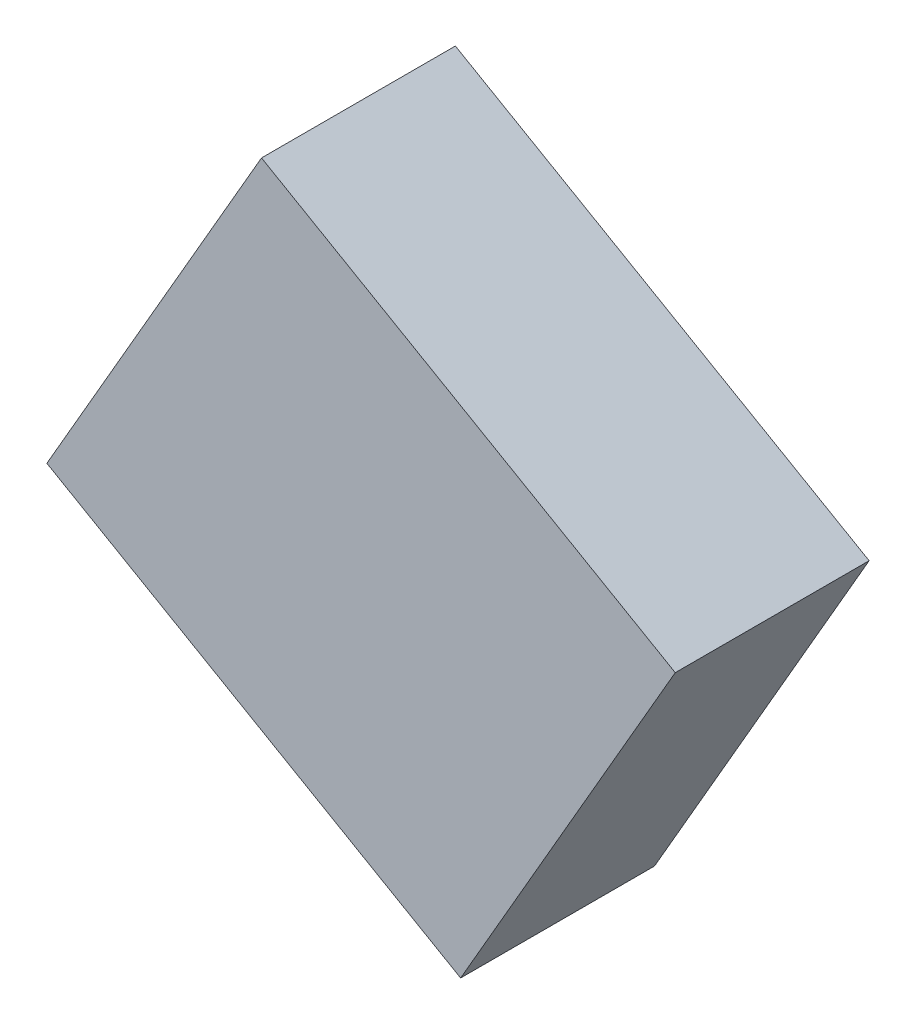
ISO-10303-21;
HEADER;
FILE_DESCRIPTION(('STEP AP214'),'2;1');
FILE_NAME('part.step','',(''),(''),'','','');
FILE_SCHEMA(('AUTOMOTIVE_DESIGN { 1 0 10303 214 1 1 1 1 }'));
ENDSEC;
DATA;
#1=APPLICATION_CONTEXT('core data for automotive mechanical design processes');
#2=APPLICATION_PROTOCOL_DEFINITION('international standard','automotive_design',2000,#1);
#3=PRODUCT_CONTEXT('',#1,'mechanical');
#4=PRODUCT('Part','Part','',(#3));
#5=PRODUCT_RELATED_PRODUCT_CATEGORY('part','',(#4));
#6=PRODUCT_DEFINITION_FORMATION('','',#4);
#7=PRODUCT_DEFINITION_CONTEXT('part definition',#1,'design');
#8=PRODUCT_DEFINITION('design','',#6,#7);
#9=PRODUCT_DEFINITION_SHAPE('','',#8);
#10=(LENGTH_UNIT() NAMED_UNIT(*) SI_UNIT(.MILLI.,.METRE.));
#11=(NAMED_UNIT(*) PLANE_ANGLE_UNIT() SI_UNIT($,.RADIAN.));
#12=(NAMED_UNIT(*) SI_UNIT($,.STERADIAN.) SOLID_ANGLE_UNIT());
#13=UNCERTAINTY_MEASURE_WITH_UNIT(LENGTH_MEASURE(1.E-05),#10,'distance_accuracy_value','');
#14=(GEOMETRIC_REPRESENTATION_CONTEXT(3) GLOBAL_UNCERTAINTY_ASSIGNED_CONTEXT((#13)) GLOBAL_UNIT_ASSIGNED_CONTEXT((#10,
#11,#12)) REPRESENTATION_CONTEXT('',''));
#15=CARTESIAN_POINT('',(0.,0.,0.));
#16=DIRECTION('',(0.,0.,1.));
#17=DIRECTION('',(1.,0.,0.));
#18=AXIS2_PLACEMENT_3D('',#15,#16,#17);
#19=CARTESIAN_POINT('',(-0.71889366,2.20483938,1.39999974));
#20=DIRECTION('',(0.,0.,-1.));
#21=DIRECTION('',(-1.,0.,0.));
#22=AXIS2_PLACEMENT_3D('',#19,#20,#21);
#23=PLANE('',#22);
#24=DIRECTION('',(-0.8660251598711,0.500000422470058,0.));
#25=VECTOR('',#24,1.);
#26=CARTESIAN_POINT('',(-2.2688931,-0.47983648,1.39999974));
#27=LINE('',#26,#25);
#28=CARTESIAN_POINT('',(-2.26889310000001,-0.479836479999993,1.39999974));
#29=VERTEX_POINT('',#28);
#30=CARTESIAN_POINT('',(0.718896199999887,-2.2048393800002,1.39999974));
#31=VERTEX_POINT('',#30);
#32=EDGE_CURVE('E55',#29,#31,#27,.F.);
#33=ORIENTED_EDGE('',*,*,#32,.T.);
#34=DIRECTION('',(-0.499999913646723,-0.866025453640521,0.));
#35=VECTOR('',#34,1.);
#36=CARTESIAN_POINT('',(0.7188962,-2.20483938,1.39999974));
#37=LINE('',#36,#35);
#38=CARTESIAN_POINT('',(2.26889564000015,0.479839019999916,1.39999974));
#39=VERTEX_POINT('',#38);
#40=EDGE_CURVE('E57',#31,#39,#37,.F.);
#41=ORIENTED_EDGE('',*,*,#40,.T.);
#42=DIRECTION('',(0.866025478669049,-0.499999870296028,0.));
#43=VECTOR('',#42,1.);
#44=CARTESIAN_POINT('',(2.26889564,0.47983902,1.39999974));
#45=LINE('',#44,#43);
#46=CARTESIAN_POINT('',(-0.718893660000355,2.20483937999939,1.39999974));
#47=VERTEX_POINT('',#46);
#48=EDGE_CURVE('E20',#39,#47,#45,.F.);
#49=ORIENTED_EDGE('',*,*,#48,.T.);
#50=DIRECTION('',(0.500000268437841,0.866025248801724,0.));
#51=VECTOR('',#50,1.);
#52=CARTESIAN_POINT('',(-0.71889366,2.20483938,1.39999974));
#53=LINE('',#52,#51);
#54=EDGE_CURVE('E80',#47,#29,#53,.F.);
#55=ORIENTED_EDGE('',*,*,#54,.T.);
#56=EDGE_LOOP('',(#33,#41,#49,#55));
#57=FACE_BOUND('',#56,.T.);
#58=ADVANCED_FACE('F17',(#57),#23,.F.);
#59=CARTESIAN_POINT('',(2.26889564,0.47983902,0.));
#60=DIRECTION('',(-0.499999870296028,-0.866025478669049,0.));
#61=DIRECTION('',(0.866025478669049,-0.499999870296028,0.));
#62=AXIS2_PLACEMENT_3D('',#59,#60,#61);
#63=PLANE('',#62);
#64=DIRECTION('',(0.,0.,1.));
#65=VECTOR('',#64,1.);
#66=CARTESIAN_POINT('',(-0.71889366,2.20483938,0.));
#67=LINE('',#66,#65);
#68=CARTESIAN_POINT('',(-0.718893660000355,2.20483937999939,0.));
#69=VERTEX_POINT('',#68);
#70=EDGE_CURVE('E68',#69,#47,#67,.T.);
#71=ORIENTED_EDGE('',*,*,#70,.T.);
#72=ORIENTED_EDGE('',*,*,#48,.F.);
#73=DIRECTION('',(0.,0.,1.));
#74=VECTOR('',#73,1.);
#75=CARTESIAN_POINT('',(2.26889564000058,0.479839019999665,0.));
#76=LINE('',#75,#74);
#77=CARTESIAN_POINT('',(2.26889564000015,0.479839019999916,0.));
#78=VERTEX_POINT('',#77);
#79=EDGE_CURVE('E63',#39,#78,#76,.F.);
#80=ORIENTED_EDGE('',*,*,#79,.T.);
#81=DIRECTION('',(0.866025478668843,-0.499999870296385,0.));
#82=VECTOR('',#81,1.);
#83=CARTESIAN_POINT('',(-0.71889366,2.20483938,0.));
#84=LINE('',#83,#82);
#85=EDGE_CURVE('E83',#69,#78,#84,.T.);
#86=ORIENTED_EDGE('',*,*,#85,.F.);
#87=EDGE_LOOP('',(#71,#72,#80,#86));
#88=FACE_BOUND('',#87,.T.);
#89=ADVANCED_FACE('F65',(#88),#63,.F.);
#90=CARTESIAN_POINT('',(0.7188962,-2.20483938,0.));
#91=DIRECTION('',(-0.866025453640521,0.499999913646723,0.));
#92=DIRECTION('',(-0.499999913646723,-0.866025453640521,0.));
#93=AXIS2_PLACEMENT_3D('',#90,#91,#92);
#94=PLANE('',#93);
#95=ORIENTED_EDGE('',*,*,#79,.F.);
#96=ORIENTED_EDGE('',*,*,#40,.F.);
#97=DIRECTION('',(0.,0.,1.));
#98=VECTOR('',#97,1.);
#99=CARTESIAN_POINT('',(0.718896199999547,-2.20483938000079,0.));
#100=LINE('',#99,#98);
#101=CARTESIAN_POINT('',(0.718896199999887,-2.2048393800002,0.));
#102=VERTEX_POINT('',#101);
#103=EDGE_CURVE('E75',#31,#102,#100,.F.);
#104=ORIENTED_EDGE('',*,*,#103,.T.);
#105=DIRECTION('',(-0.499999913646536,-0.866025453640629,0.));
#106=VECTOR('',#105,1.);
#107=CARTESIAN_POINT('',(2.26889564,0.47983902,0.));
#108=LINE('',#107,#106);
#109=EDGE_CURVE('E72',#78,#102,#108,.T.);
#110=ORIENTED_EDGE('',*,*,#109,.F.);
#111=EDGE_LOOP('',(#95,#96,#104,#110));
#112=FACE_BOUND('',#111,.T.);
#113=ADVANCED_FACE('F70',(#112),#94,.F.);
#114=CARTESIAN_POINT('',(-2.2688931,-0.47983648,0.));
#115=DIRECTION('',(0.500000422470058,0.8660251598711,0.));
#116=DIRECTION('',(-0.8660251598711,0.500000422470058,0.));
#117=AXIS2_PLACEMENT_3D('',#114,#115,#116);
#118=PLANE('',#117);
#119=ORIENTED_EDGE('',*,*,#103,.F.);
#120=ORIENTED_EDGE('',*,*,#32,.F.);
#121=DIRECTION('',(0.,0.,1.));
#122=VECTOR('',#121,1.);
#123=CARTESIAN_POINT('',(-2.26889310000005,-0.479836479999971,0.));
#124=LINE('',#123,#122);
#125=CARTESIAN_POINT('',(-2.26889310000001,-0.479836479999993,0.));
#126=VERTEX_POINT('',#125);
#127=EDGE_CURVE('E35',#29,#126,#124,.F.);
#128=ORIENTED_EDGE('',*,*,#127,.T.);
#129=DIRECTION('',(-0.866025159871231,0.50000042246983,0.));
#130=VECTOR('',#129,1.);
#131=CARTESIAN_POINT('',(0.7188962,-2.20483938,0.));
#132=LINE('',#131,#130);
#133=EDGE_CURVE('E26',#102,#126,#132,.T.);
#134=ORIENTED_EDGE('',*,*,#133,.F.);
#135=EDGE_LOOP('',(#119,#120,#128,#134));
#136=FACE_BOUND('',#135,.T.);
#137=ADVANCED_FACE('F89',(#136),#118,.F.);
#138=CARTESIAN_POINT('',(-0.71889366,2.20483938,0.));
#139=DIRECTION('',(0.866025248801724,-0.500000268437841,0.));
#140=DIRECTION('',(0.500000268437841,0.866025248801724,0.));
#141=AXIS2_PLACEMENT_3D('',#138,#139,#140);
#142=PLANE('',#141);
#143=ORIENTED_EDGE('',*,*,#127,.F.);
#144=ORIENTED_EDGE('',*,*,#54,.F.);
#145=ORIENTED_EDGE('',*,*,#70,.F.);
#146=DIRECTION('',(0.500000268437824,0.866025248801733,0.));
#147=VECTOR('',#146,1.);
#148=CARTESIAN_POINT('',(-2.2688931,-0.47983648,0.));
#149=LINE('',#148,#147);
#150=EDGE_CURVE('E11',#126,#69,#149,.T.);
#151=ORIENTED_EDGE('',*,*,#150,.F.);
#152=EDGE_LOOP('',(#143,#144,#145,#151));
#153=FACE_BOUND('',#152,.T.);
#154=ADVANCED_FACE('F91',(#153),#142,.F.);
#155=CARTESIAN_POINT('',(-0.71889366,2.20483938,0.));
#156=DIRECTION('',(0.,0.,-1.));
#157=DIRECTION('',(-1.,0.,0.));
#158=AXIS2_PLACEMENT_3D('',#155,#156,#157);
#159=PLANE('',#158);
#160=ORIENTED_EDGE('',*,*,#133,.T.);
#161=ORIENTED_EDGE('',*,*,#150,.T.);
#162=ORIENTED_EDGE('',*,*,#85,.T.);
#163=ORIENTED_EDGE('',*,*,#109,.T.);
#164=EDGE_LOOP('',(#160,#161,#162,#163));
#165=FACE_BOUND('',#164,.T.);
#166=ADVANCED_FACE('F88',(#165),#159,.T.);
#167=CLOSED_SHELL('',(#58,#89,#113,#137,#154,#166));
#168=MANIFOLD_SOLID_BREP('B1',#167);
#169=ADVANCED_BREP_SHAPE_REPRESENTATION('',(#18,#168),#14);
#170=SHAPE_DEFINITION_REPRESENTATION(#9,#169);
ENDSEC;
END-ISO-10303-21;
